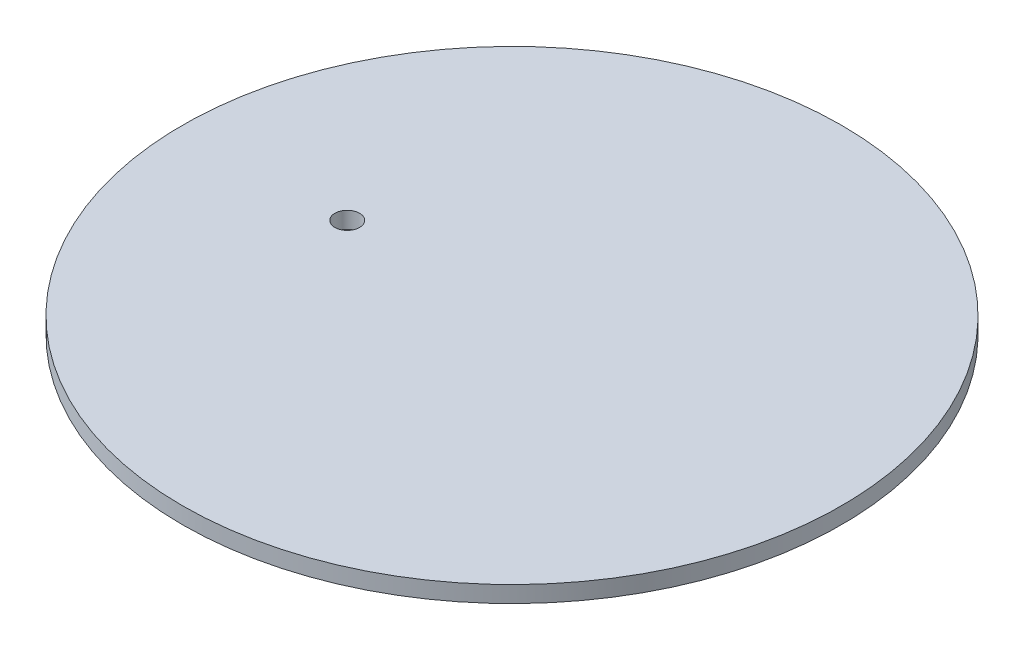
ISO-10303-21;
HEADER;
FILE_DESCRIPTION(('STEP AP214'),'2;1');
FILE_NAME('part.step','',(''),(''),'','','');
FILE_SCHEMA(('AUTOMOTIVE_DESIGN { 1 0 10303 214 1 1 1 1 }'));
ENDSEC;
DATA;
#1=APPLICATION_CONTEXT('core data for automotive mechanical design processes');
#2=APPLICATION_PROTOCOL_DEFINITION('international standard','automotive_design',2000,#1);
#3=PRODUCT_CONTEXT('',#1,'mechanical');
#4=PRODUCT('Part','Part','',(#3));
#5=PRODUCT_RELATED_PRODUCT_CATEGORY('part','',(#4));
#6=PRODUCT_DEFINITION_FORMATION('','',#4);
#7=PRODUCT_DEFINITION_CONTEXT('part definition',#1,'design');
#8=PRODUCT_DEFINITION('design','',#6,#7);
#9=PRODUCT_DEFINITION_SHAPE('','',#8);
#10=(LENGTH_UNIT() NAMED_UNIT(*) SI_UNIT(.MILLI.,.METRE.));
#11=(NAMED_UNIT(*) PLANE_ANGLE_UNIT() SI_UNIT($,.RADIAN.));
#12=(NAMED_UNIT(*) SI_UNIT($,.STERADIAN.) SOLID_ANGLE_UNIT());
#13=UNCERTAINTY_MEASURE_WITH_UNIT(LENGTH_MEASURE(1.E-05),#10,'distance_accuracy_value','');
#14=(GEOMETRIC_REPRESENTATION_CONTEXT(3) GLOBAL_UNCERTAINTY_ASSIGNED_CONTEXT((#13)) GLOBAL_UNIT_ASSIGNED_CONTEXT((#10,
#11,#12)) REPRESENTATION_CONTEXT('',''));
#15=CARTESIAN_POINT('',(0.,0.,0.));
#16=DIRECTION('',(0.,0.,1.));
#17=DIRECTION('',(1.,0.,0.));
#18=AXIS2_PLACEMENT_3D('',#15,#16,#17);
#19=CARTESIAN_POINT('',(0.,6.35,0.));
#20=DIRECTION('',(0.,-1.,0.));
#21=DIRECTION('',(0.,0.,-1.));
#22=AXIS2_PLACEMENT_3D('',#19,#20,#21);
#23=CYLINDRICAL_SURFACE('',#22,127.);
#24=CARTESIAN_POINT('',(0.,6.35,0.));
#25=DIRECTION('',(0.,1.,0.));
#26=DIRECTION('',(0.,0.,1.));
#27=AXIS2_PLACEMENT_3D('',#24,#25,#26);
#28=CIRCLE('',#27,127.);
#29=CARTESIAN_POINT('',(0.,6.35,127.));
#30=VERTEX_POINT('',#29);
#31=EDGE_CURVE('E10',#30,#30,#28,.T.);
#32=ORIENTED_EDGE('',*,*,#31,.F.);
#33=EDGE_LOOP('',(#32));
#34=FACE_BOUND('',#33,.T.);
#35=CARTESIAN_POINT('',(0.,0.,0.));
#36=DIRECTION('',(0.,1.,0.));
#37=DIRECTION('',(0.,0.,1.));
#38=AXIS2_PLACEMENT_3D('',#35,#36,#37);
#39=CIRCLE('',#38,127.);
#40=CARTESIAN_POINT('',(0.,0.,127.));
#41=VERTEX_POINT('',#40);
#42=EDGE_CURVE('E40',#41,#41,#39,.T.);
#43=ORIENTED_EDGE('',*,*,#42,.T.);
#44=EDGE_LOOP('',(#43));
#45=FACE_BOUND('',#44,.T.);
#46=ADVANCED_FACE('F37',(#34,#45),#23,.T.);
#47=CARTESIAN_POINT('',(0.,6.35,0.));
#48=DIRECTION('',(0.,1.,0.));
#49=DIRECTION('',(0.,0.,1.));
#50=AXIS2_PLACEMENT_3D('',#47,#48,#49);
#51=PLANE('',#50);
#52=CARTESIAN_POINT('',(-63.5,6.35,0.));
#53=DIRECTION('',(0.,1.,0.));
#54=DIRECTION('',(0.,0.,1.));
#55=AXIS2_PLACEMENT_3D('',#52,#53,#54);
#56=CIRCLE('',#55,4.7625);
#57=CARTESIAN_POINT('',(-63.5,6.35,4.7625));
#58=VERTEX_POINT('',#57);
#59=EDGE_CURVE('E51',#58,#58,#56,.T.);
#60=ORIENTED_EDGE('',*,*,#59,.F.);
#61=EDGE_LOOP('',(#60));
#62=FACE_BOUND('',#61,.T.);
#63=ORIENTED_EDGE('',*,*,#31,.T.);
#64=EDGE_LOOP('',(#63));
#65=FACE_BOUND('',#64,.T.);
#66=ADVANCED_FACE('F68',(#62,#65),#51,.T.);
#67=CARTESIAN_POINT('',(0.,0.,0.));
#68=DIRECTION('',(0.,1.,0.));
#69=DIRECTION('',(0.,0.,1.));
#70=AXIS2_PLACEMENT_3D('',#67,#68,#69);
#71=PLANE('',#70);
#72=CARTESIAN_POINT('',(-63.5,0.,0.));
#73=DIRECTION('',(0.,1.,0.));
#74=DIRECTION('',(0.,0.,1.));
#75=AXIS2_PLACEMENT_3D('',#72,#73,#74);
#76=CIRCLE('',#75,4.7625);
#77=CARTESIAN_POINT('',(-63.5,0.,4.7625));
#78=VERTEX_POINT('',#77);
#79=EDGE_CURVE('E49',#78,#78,#76,.T.);
#80=ORIENTED_EDGE('',*,*,#79,.T.);
#81=EDGE_LOOP('',(#80));
#82=FACE_BOUND('',#81,.T.);
#83=ORIENTED_EDGE('',*,*,#42,.F.);
#84=EDGE_LOOP('',(#83));
#85=FACE_BOUND('',#84,.T.);
#86=ADVANCED_FACE('F59',(#82,#85),#71,.F.);
#87=CARTESIAN_POINT('',(-63.5,0.,0.));
#88=DIRECTION('',(0.,1.,0.));
#89=DIRECTION('',(0.,0.,1.));
#90=AXIS2_PLACEMENT_3D('',#87,#88,#89);
#91=CYLINDRICAL_SURFACE('',#90,4.7625);
#92=ORIENTED_EDGE('',*,*,#79,.F.);
#93=EDGE_LOOP('',(#92));
#94=FACE_BOUND('',#93,.T.);
#95=ORIENTED_EDGE('',*,*,#59,.T.);
#96=EDGE_LOOP('',(#95));
#97=FACE_BOUND('',#96,.T.);
#98=ADVANCED_FACE('F62',(#94,#97),#91,.F.);
#99=CLOSED_SHELL('',(#46,#66,#86,#98));
#100=MANIFOLD_SOLID_BREP('B2',#99);
#101=ADVANCED_BREP_SHAPE_REPRESENTATION('',(#18,#100),#14);
#102=SHAPE_DEFINITION_REPRESENTATION(#9,#101);
ENDSEC;
END-ISO-10303-21;
